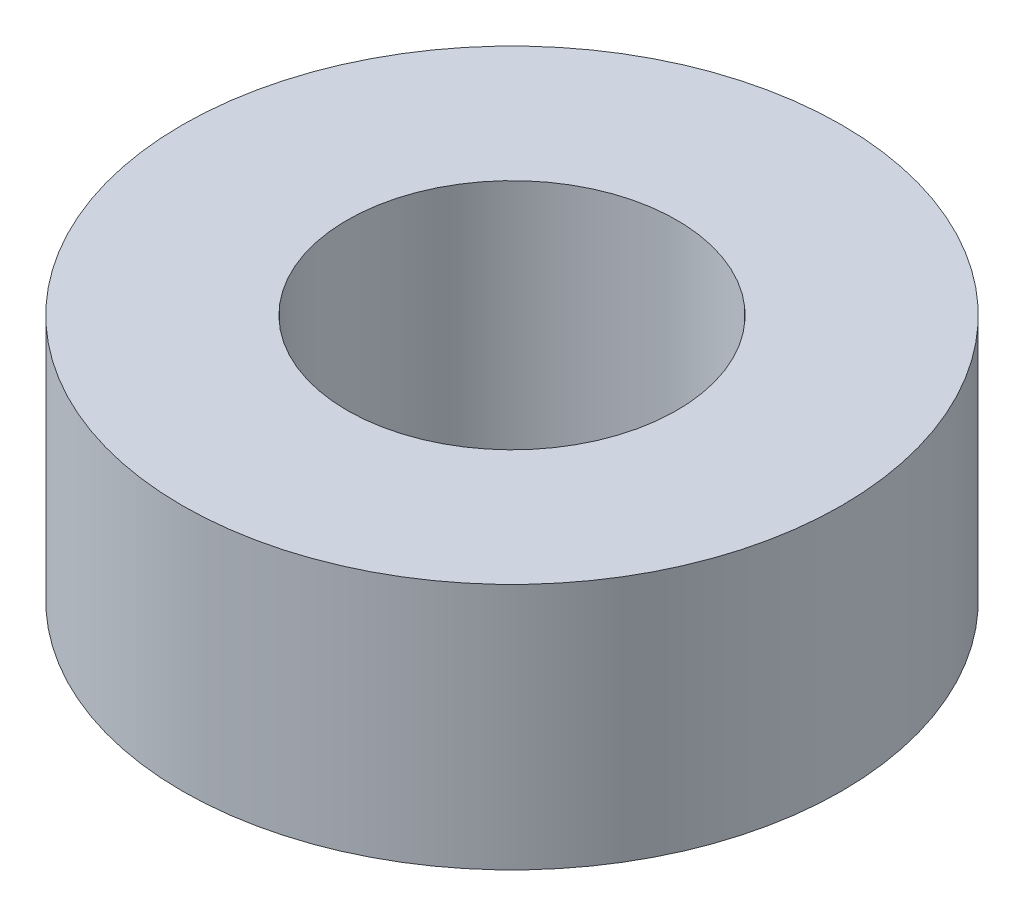
ISO-10303-21;
HEADER;
FILE_DESCRIPTION(('STEP AP214'),'2;1');
FILE_NAME('part.step','',(''),(''),'','','');
FILE_SCHEMA(('AUTOMOTIVE_DESIGN { 1 0 10303 214 1 1 1 1 }'));
ENDSEC;
DATA;
#1=APPLICATION_CONTEXT('core data for automotive mechanical design processes');
#2=APPLICATION_PROTOCOL_DEFINITION('international standard','automotive_design',2000,#1);
#3=PRODUCT_CONTEXT('',#1,'mechanical');
#4=PRODUCT('Part','Part','',(#3));
#5=PRODUCT_RELATED_PRODUCT_CATEGORY('part','',(#4));
#6=PRODUCT_DEFINITION_FORMATION('','',#4);
#7=PRODUCT_DEFINITION_CONTEXT('part definition',#1,'design');
#8=PRODUCT_DEFINITION('design','',#6,#7);
#9=PRODUCT_DEFINITION_SHAPE('','',#8);
#10=(LENGTH_UNIT() NAMED_UNIT(*) SI_UNIT(.MILLI.,.METRE.));
#11=(NAMED_UNIT(*) PLANE_ANGLE_UNIT() SI_UNIT($,.RADIAN.));
#12=(NAMED_UNIT(*) SI_UNIT($,.STERADIAN.) SOLID_ANGLE_UNIT());
#13=UNCERTAINTY_MEASURE_WITH_UNIT(LENGTH_MEASURE(1.E-05),#10,'distance_accuracy_value','');
#14=(GEOMETRIC_REPRESENTATION_CONTEXT(3) GLOBAL_UNCERTAINTY_ASSIGNED_CONTEXT((#13)) GLOBAL_UNIT_ASSIGNED_CONTEXT((#10,
#11,#12)) REPRESENTATION_CONTEXT('',''));
#15=CARTESIAN_POINT('',(0.,0.,0.));
#16=DIRECTION('',(0.,0.,1.));
#17=DIRECTION('',(1.,0.,0.));
#18=AXIS2_PLACEMENT_3D('',#15,#16,#17);
#19=CARTESIAN_POINT('',(0.,2.38125,0.));
#20=DIRECTION('',(0.,1.,0.));
#21=DIRECTION('',(0.,0.,1.));
#22=AXIS2_PLACEMENT_3D('',#19,#20,#21);
#23=PLANE('',#22);
#24=CARTESIAN_POINT('',(0.,2.38125,0.));
#25=DIRECTION('',(0.,1.,0.));
#26=DIRECTION('',(0.,0.,1.));
#27=AXIS2_PLACEMENT_3D('',#24,#25,#26);
#28=CIRCLE('',#27,6.35);
#29=CARTESIAN_POINT('',(0.,2.38125,6.35));
#30=VERTEX_POINT('',#29);
#31=EDGE_CURVE('E10',#30,#30,#28,.T.);
#32=ORIENTED_EDGE('',*,*,#31,.T.);
#33=EDGE_LOOP('',(#32));
#34=FACE_BOUND('',#33,.T.);
#35=CARTESIAN_POINT('',(0.,2.38125,0.));
#36=DIRECTION('',(0.,1.,0.));
#37=DIRECTION('',(0.,0.,1.));
#38=AXIS2_PLACEMENT_3D('',#35,#36,#37);
#39=CIRCLE('',#38,3.175);
#40=CARTESIAN_POINT('',(0.,2.38125,3.175));
#41=VERTEX_POINT('',#40);
#42=EDGE_CURVE('E25',#41,#41,#39,.T.);
#43=ORIENTED_EDGE('',*,*,#42,.F.);
#44=EDGE_LOOP('',(#43));
#45=FACE_BOUND('',#44,.T.);
#46=ADVANCED_FACE('F14',(#34,#45),#23,.T.);
#47=CARTESIAN_POINT('',(0.,-2.38125,0.));
#48=DIRECTION('',(0.,1.,0.));
#49=DIRECTION('',(0.,0.,1.));
#50=AXIS2_PLACEMENT_3D('',#47,#48,#49);
#51=PLANE('',#50);
#52=CARTESIAN_POINT('',(0.,-2.38125,0.));
#53=DIRECTION('',(0.,1.,0.));
#54=DIRECTION('',(0.,0.,1.));
#55=AXIS2_PLACEMENT_3D('',#52,#53,#54);
#56=CIRCLE('',#55,6.35);
#57=CARTESIAN_POINT('',(0.,-2.38125,6.35));
#58=VERTEX_POINT('',#57);
#59=EDGE_CURVE('E18',#58,#58,#56,.T.);
#60=ORIENTED_EDGE('',*,*,#59,.F.);
#61=EDGE_LOOP('',(#60));
#62=FACE_BOUND('',#61,.T.);
#63=CARTESIAN_POINT('',(0.,-2.38125,0.));
#64=DIRECTION('',(0.,1.,0.));
#65=DIRECTION('',(0.,0.,1.));
#66=AXIS2_PLACEMENT_3D('',#63,#64,#65);
#67=CIRCLE('',#66,3.175);
#68=CARTESIAN_POINT('',(0.,-2.38125,3.175));
#69=VERTEX_POINT('',#68);
#70=EDGE_CURVE('E27',#69,#69,#67,.T.);
#71=ORIENTED_EDGE('',*,*,#70,.T.);
#72=EDGE_LOOP('',(#71));
#73=FACE_BOUND('',#72,.T.);
#74=ADVANCED_FACE('F37',(#62,#73),#51,.F.);
#75=CARTESIAN_POINT('',(0.,2.38125,0.));
#76=DIRECTION('',(0.,-1.,0.));
#77=DIRECTION('',(0.,0.,-1.));
#78=AXIS2_PLACEMENT_3D('',#75,#76,#77);
#79=CYLINDRICAL_SURFACE('',#78,6.35);
#80=ORIENTED_EDGE('',*,*,#31,.F.);
#81=EDGE_LOOP('',(#80));
#82=FACE_BOUND('',#81,.T.);
#83=ORIENTED_EDGE('',*,*,#59,.T.);
#84=EDGE_LOOP('',(#83));
#85=FACE_BOUND('',#84,.T.);
#86=ADVANCED_FACE('F16',(#82,#85),#79,.T.);
#87=CARTESIAN_POINT('',(0.,2.38125,0.));
#88=DIRECTION('',(0.,-1.,0.));
#89=DIRECTION('',(0.,0.,-1.));
#90=AXIS2_PLACEMENT_3D('',#87,#88,#89);
#91=CYLINDRICAL_SURFACE('',#90,3.175);
#92=ORIENTED_EDGE('',*,*,#42,.T.);
#93=EDGE_LOOP('',(#92));
#94=FACE_BOUND('',#93,.T.);
#95=ORIENTED_EDGE('',*,*,#70,.F.);
#96=EDGE_LOOP('',(#95));
#97=FACE_BOUND('',#96,.T.);
#98=ADVANCED_FACE('F33',(#94,#97),#91,.F.);
#99=CLOSED_SHELL('',(#46,#74,#86,#98));
#100=MANIFOLD_SOLID_BREP('B1',#99);
#101=ADVANCED_BREP_SHAPE_REPRESENTATION('',(#18,#100),#14);
#102=SHAPE_DEFINITION_REPRESENTATION(#9,#101);
ENDSEC;
END-ISO-10303-21;
